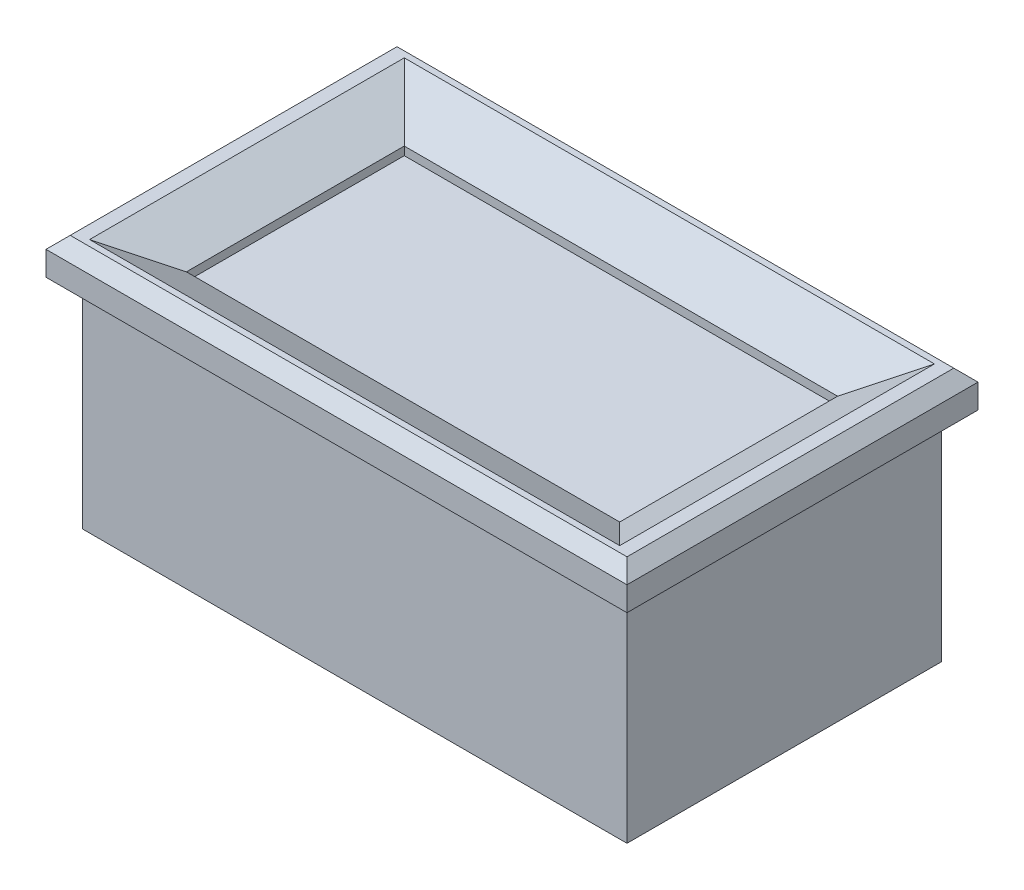
ISO-10303-21;
HEADER;
FILE_DESCRIPTION(('STEP AP214'),'2;1');
FILE_NAME('part.step','',(''),(''),'','','');
FILE_SCHEMA(('AUTOMOTIVE_DESIGN { 1 0 10303 214 1 1 1 1 }'));
ENDSEC;
DATA;
#1=APPLICATION_CONTEXT('core data for automotive mechanical design processes');
#2=APPLICATION_PROTOCOL_DEFINITION('international standard','automotive_design',2000,#1);
#3=PRODUCT_CONTEXT('',#1,'mechanical');
#4=PRODUCT('Part','Part','',(#3));
#5=PRODUCT_RELATED_PRODUCT_CATEGORY('part','',(#4));
#6=PRODUCT_DEFINITION_FORMATION('','',#4);
#7=PRODUCT_DEFINITION_CONTEXT('part definition',#1,'design');
#8=PRODUCT_DEFINITION('design','',#6,#7);
#9=PRODUCT_DEFINITION_SHAPE('','',#8);
#10=(LENGTH_UNIT() NAMED_UNIT(*) SI_UNIT(.MILLI.,.METRE.));
#11=(NAMED_UNIT(*) PLANE_ANGLE_UNIT() SI_UNIT($,.RADIAN.));
#12=(NAMED_UNIT(*) SI_UNIT($,.STERADIAN.) SOLID_ANGLE_UNIT());
#13=UNCERTAINTY_MEASURE_WITH_UNIT(LENGTH_MEASURE(1.E-05),#10,'distance_accuracy_value','');
#14=(GEOMETRIC_REPRESENTATION_CONTEXT(3) GLOBAL_UNCERTAINTY_ASSIGNED_CONTEXT((#13)) GLOBAL_UNIT_ASSIGNED_CONTEXT((#10,
#11,#12)) REPRESENTATION_CONTEXT('',''));
#15=CARTESIAN_POINT('',(0.,0.,0.));
#16=DIRECTION('',(0.,0.,1.));
#17=DIRECTION('',(1.,0.,0.));
#18=AXIS2_PLACEMENT_3D('',#15,#16,#17);
#19=CARTESIAN_POINT('',(22.5,18.,13.));
#20=DIRECTION('',(-1.,0.,0.));
#21=DIRECTION('',(0.,0.,1.));
#22=AXIS2_PLACEMENT_3D('',#19,#20,#21);
#23=PLANE('',#22);
#24=DIRECTION('',(0.,0.,-1.));
#25=VECTOR('',#24,1.);
#26=CARTESIAN_POINT('',(22.5,0.,13.));
#27=LINE('',#26,#25);
#28=CARTESIAN_POINT('',(22.5,0.,13.));
#29=VERTEX_POINT('',#28);
#30=CARTESIAN_POINT('',(22.5,0.,-13.));
#31=VERTEX_POINT('',#30);
#32=EDGE_CURVE('E225',#29,#31,#27,.T.);
#33=ORIENTED_EDGE('',*,*,#32,.T.);
#34=DIRECTION('',(0.,-1.,0.));
#35=VECTOR('',#34,1.);
#36=CARTESIAN_POINT('',(22.5,18.,-13.));
#37=LINE('',#36,#35);
#38=CARTESIAN_POINT('',(22.5,18.,-13.));
#39=VERTEX_POINT('',#38);
#40=EDGE_CURVE('E266',#39,#31,#37,.T.);
#41=ORIENTED_EDGE('',*,*,#40,.F.);
#42=DIRECTION('',(0.,0.,-1.));
#43=VECTOR('',#42,1.);
#44=CARTESIAN_POINT('',(22.5,18.,13.));
#45=LINE('',#44,#43);
#46=CARTESIAN_POINT('',(22.5,18.,13.));
#47=VERTEX_POINT('',#46);
#48=EDGE_CURVE('E226',#47,#39,#45,.T.);
#49=ORIENTED_EDGE('',*,*,#48,.F.);
#50=DIRECTION('',(0.,-1.,0.));
#51=VECTOR('',#50,1.);
#52=CARTESIAN_POINT('',(22.5,18.,13.));
#53=LINE('',#52,#51);
#54=EDGE_CURVE('E243',#47,#29,#53,.T.);
#55=ORIENTED_EDGE('',*,*,#54,.T.);
#56=EDGE_LOOP('',(#33,#41,#49,#55));
#57=FACE_BOUND('',#56,.T.);
#58=ADVANCED_FACE('F39',(#57),#23,.F.);
#59=CARTESIAN_POINT('',(-22.5,18.,-13.));
#60=DIRECTION('',(0.,0.,1.));
#61=DIRECTION('',(1.,0.,0.));
#62=AXIS2_PLACEMENT_3D('',#59,#60,#61);
#63=PLANE('',#62);
#64=DIRECTION('',(-1.,0.,0.));
#65=VECTOR('',#64,1.);
#66=CARTESIAN_POINT('',(-22.5,0.,-13.));
#67=LINE('',#66,#65);
#68=CARTESIAN_POINT('',(-22.5,0.,-13.));
#69=VERTEX_POINT('',#68);
#70=EDGE_CURVE('E247',#31,#69,#67,.T.);
#71=ORIENTED_EDGE('',*,*,#70,.T.);
#72=DIRECTION('',(0.,-1.,0.));
#73=VECTOR('',#72,1.);
#74=CARTESIAN_POINT('',(-22.5,18.,-13.));
#75=LINE('',#74,#73);
#76=CARTESIAN_POINT('',(-22.5,18.,-13.));
#77=VERTEX_POINT('',#76);
#78=EDGE_CURVE('E262',#77,#69,#75,.T.);
#79=ORIENTED_EDGE('',*,*,#78,.F.);
#80=DIRECTION('',(-1.,0.,0.));
#81=VECTOR('',#80,1.);
#82=CARTESIAN_POINT('',(-22.5,18.,-13.));
#83=LINE('',#82,#81);
#84=EDGE_CURVE('E230',#39,#77,#83,.T.);
#85=ORIENTED_EDGE('',*,*,#84,.F.);
#86=ORIENTED_EDGE('',*,*,#40,.T.);
#87=EDGE_LOOP('',(#71,#79,#85,#86));
#88=FACE_BOUND('',#87,.T.);
#89=ADVANCED_FACE('F362',(#88),#63,.F.);
#90=CARTESIAN_POINT('',(-22.5,18.,13.));
#91=DIRECTION('',(1.,0.,0.));
#92=DIRECTION('',(0.,0.,-1.));
#93=AXIS2_PLACEMENT_3D('',#90,#91,#92);
#94=PLANE('',#93);
#95=DIRECTION('',(0.,0.,1.));
#96=VECTOR('',#95,1.);
#97=CARTESIAN_POINT('',(-22.5,0.,13.));
#98=LINE('',#97,#96);
#99=CARTESIAN_POINT('',(-22.5,0.,13.));
#100=VERTEX_POINT('',#99);
#101=EDGE_CURVE('E250',#69,#100,#98,.T.);
#102=ORIENTED_EDGE('',*,*,#101,.T.);
#103=DIRECTION('',(0.,-1.,0.));
#104=VECTOR('',#103,1.);
#105=CARTESIAN_POINT('',(-22.5,18.,13.));
#106=LINE('',#105,#104);
#107=CARTESIAN_POINT('',(-22.5,18.,13.));
#108=VERTEX_POINT('',#107);
#109=EDGE_CURVE('E258',#108,#100,#106,.T.);
#110=ORIENTED_EDGE('',*,*,#109,.F.);
#111=DIRECTION('',(0.,0.,1.));
#112=VECTOR('',#111,1.);
#113=CARTESIAN_POINT('',(-22.5,18.,13.));
#114=LINE('',#113,#112);
#115=EDGE_CURVE('E235',#77,#108,#114,.T.);
#116=ORIENTED_EDGE('',*,*,#115,.F.);
#117=ORIENTED_EDGE('',*,*,#78,.T.);
#118=EDGE_LOOP('',(#102,#110,#116,#117));
#119=FACE_BOUND('',#118,.T.);
#120=ADVANCED_FACE('F368',(#119),#94,.F.);
#121=CARTESIAN_POINT('',(-22.5,18.,13.));
#122=DIRECTION('',(0.,0.,-1.));
#123=DIRECTION('',(-1.,0.,0.));
#124=AXIS2_PLACEMENT_3D('',#121,#122,#123);
#125=PLANE('',#124);
#126=DIRECTION('',(1.,0.,0.));
#127=VECTOR('',#126,1.);
#128=CARTESIAN_POINT('',(-22.5,0.,13.));
#129=LINE('',#128,#127);
#130=EDGE_CURVE('E231',#100,#29,#129,.T.);
#131=ORIENTED_EDGE('',*,*,#130,.T.);
#132=ORIENTED_EDGE('',*,*,#54,.F.);
#133=DIRECTION('',(1.,0.,0.));
#134=VECTOR('',#133,1.);
#135=CARTESIAN_POINT('',(-22.5,18.,13.));
#136=LINE('',#135,#134);
#137=EDGE_CURVE('E239',#108,#47,#136,.T.);
#138=ORIENTED_EDGE('',*,*,#137,.F.);
#139=ORIENTED_EDGE('',*,*,#109,.T.);
#140=EDGE_LOOP('',(#131,#132,#138,#139));
#141=FACE_BOUND('',#140,.T.);
#142=ADVANCED_FACE('F432',(#141),#125,.F.);
#143=CARTESIAN_POINT('',(0.,0.,0.));
#144=DIRECTION('',(0.,-1.,0.));
#145=DIRECTION('',(0.,0.,-1.));
#146=AXIS2_PLACEMENT_3D('',#143,#144,#145);
#147=PLANE('',#146);
#148=ORIENTED_EDGE('',*,*,#32,.F.);
#149=ORIENTED_EDGE('',*,*,#130,.F.);
#150=ORIENTED_EDGE('',*,*,#101,.F.);
#151=ORIENTED_EDGE('',*,*,#70,.F.);
#152=EDGE_LOOP('',(#148,#149,#150,#151));
#153=FACE_BOUND('',#152,.T.);
#154=ADVANCED_FACE('F425',(#153),#147,.T.);
#155=CARTESIAN_POINT('',(0.,18.,0.));
#156=DIRECTION('',(0.,-1.,0.));
#157=DIRECTION('',(0.,0.,-1.));
#158=AXIS2_PLACEMENT_3D('',#155,#156,#157);
#159=PLANE('',#158);
#160=DIRECTION('',(0.,0.,-1.));
#161=VECTOR('',#160,1.);
#162=CARTESIAN_POINT('',(24.,18.,14.5));
#163=LINE('',#162,#161);
#164=CARTESIAN_POINT('',(24.,18.,14.5));
#165=VERTEX_POINT('',#164);
#166=CARTESIAN_POINT('',(24.,18.,-14.5));
#167=VERTEX_POINT('',#166);
#168=EDGE_CURVE('E163',#165,#167,#163,.T.);
#169=ORIENTED_EDGE('',*,*,#168,.F.);
#170=DIRECTION('',(1.,0.,0.));
#171=VECTOR('',#170,1.);
#172=CARTESIAN_POINT('',(-24.,18.,14.5));
#173=LINE('',#172,#171);
#174=CARTESIAN_POINT('',(-24.,18.,14.5));
#175=VERTEX_POINT('',#174);
#176=EDGE_CURVE('E209',#175,#165,#173,.T.);
#177=ORIENTED_EDGE('',*,*,#176,.F.);
#178=DIRECTION('',(0.,0.,1.));
#179=VECTOR('',#178,1.);
#180=CARTESIAN_POINT('',(-24.,18.,14.5));
#181=LINE('',#180,#179);
#182=CARTESIAN_POINT('',(-24.,18.,-14.5));
#183=VERTEX_POINT('',#182);
#184=EDGE_CURVE('E205',#183,#175,#181,.T.);
#185=ORIENTED_EDGE('',*,*,#184,.F.);
#186=DIRECTION('',(-1.,0.,0.));
#187=VECTOR('',#186,1.);
#188=CARTESIAN_POINT('',(-24.,18.,-14.5));
#189=LINE('',#188,#187);
#190=EDGE_CURVE('E201',#167,#183,#189,.T.);
#191=ORIENTED_EDGE('',*,*,#190,.F.);
#192=EDGE_LOOP('',(#169,#177,#185,#191));
#193=FACE_BOUND('',#192,.T.);
#194=ORIENTED_EDGE('',*,*,#48,.T.);
#195=ORIENTED_EDGE('',*,*,#84,.T.);
#196=ORIENTED_EDGE('',*,*,#115,.T.);
#197=ORIENTED_EDGE('',*,*,#137,.T.);
#198=EDGE_LOOP('',(#194,#195,#196,#197));
#199=FACE_BOUND('',#198,.T.);
#200=ADVANCED_FACE('F422',(#193,#199),#159,.T.);
#201=CARTESIAN_POINT('',(0.,21.,0.));
#202=DIRECTION('',(0.,-1.,0.));
#203=DIRECTION('',(0.,0.,-1.));
#204=AXIS2_PLACEMENT_3D('',#201,#202,#203);
#205=PLANE('',#204);
#206=DIRECTION('',(1.,0.,0.));
#207=VECTOR('',#206,1.);
#208=CARTESIAN_POINT('',(17.9,21.,-13.));
#209=LINE('',#208,#207);
#210=CARTESIAN_POINT('',(-21.9,21.,-13.));
#211=VERTEX_POINT('',#210);
#212=CARTESIAN_POINT('',(21.9,21.,-13.));
#213=VERTEX_POINT('',#212);
#214=EDGE_CURVE('E307',#211,#213,#209,.T.);
#215=ORIENTED_EDGE('',*,*,#214,.T.);
#216=DIRECTION('',(0.,0.,1.));
#217=VECTOR('',#216,1.);
#218=CARTESIAN_POINT('',(21.9,21.,9.));
#219=LINE('',#218,#217);
#220=CARTESIAN_POINT('',(21.9,21.,13.));
#221=VERTEX_POINT('',#220);
#222=EDGE_CURVE('E316',#213,#221,#219,.T.);
#223=ORIENTED_EDGE('',*,*,#222,.T.);
#224=DIRECTION('',(-1.,0.,0.));
#225=VECTOR('',#224,1.);
#226=CARTESIAN_POINT('',(-17.9,21.,13.));
#227=LINE('',#226,#225);
#228=CARTESIAN_POINT('',(-21.9,21.,13.));
#229=VERTEX_POINT('',#228);
#230=EDGE_CURVE('E313',#221,#229,#227,.T.);
#231=ORIENTED_EDGE('',*,*,#230,.T.);
#232=DIRECTION('',(0.,0.,-1.));
#233=VECTOR('',#232,1.);
#234=CARTESIAN_POINT('',(-21.9,21.,-9.));
#235=LINE('',#234,#233);
#236=EDGE_CURVE('E310',#229,#211,#235,.T.);
#237=ORIENTED_EDGE('',*,*,#236,.T.);
#238=EDGE_LOOP('',(#215,#223,#231,#237));
#239=FACE_BOUND('',#238,.T.);
#240=DIRECTION('',(0.,0.,-1.));
#241=VECTOR('',#240,1.);
#242=CARTESIAN_POINT('',(23.,21.,0.));
#243=LINE('',#242,#241);
#244=CARTESIAN_POINT('',(23.,21.,13.5));
#245=VERTEX_POINT('',#244);
#246=CARTESIAN_POINT('',(23.,21.,-13.5));
#247=VERTEX_POINT('',#246);
#248=EDGE_CURVE('E276',#245,#247,#243,.T.);
#249=ORIENTED_EDGE('',*,*,#248,.T.);
#250=DIRECTION('',(-1.,0.,0.));
#251=VECTOR('',#250,1.);
#252=CARTESIAN_POINT('',(0.,21.,-13.5));
#253=LINE('',#252,#251);
#254=CARTESIAN_POINT('',(-23.,21.,-13.5));
#255=VERTEX_POINT('',#254);
#256=EDGE_CURVE('E279',#247,#255,#253,.T.);
#257=ORIENTED_EDGE('',*,*,#256,.T.);
#258=DIRECTION('',(0.,0.,1.));
#259=VECTOR('',#258,1.);
#260=CARTESIAN_POINT('',(-23.,21.,0.));
#261=LINE('',#260,#259);
#262=CARTESIAN_POINT('',(-23.,21.,13.5));
#263=VERTEX_POINT('',#262);
#264=EDGE_CURVE('E273',#255,#263,#261,.T.);
#265=ORIENTED_EDGE('',*,*,#264,.T.);
#266=DIRECTION('',(1.,0.,0.));
#267=VECTOR('',#266,1.);
#268=CARTESIAN_POINT('',(0.,21.,13.5));
#269=LINE('',#268,#267);
#270=EDGE_CURVE('E270',#263,#245,#269,.T.);
#271=ORIENTED_EDGE('',*,*,#270,.T.);
#272=EDGE_LOOP('',(#249,#257,#265,#271));
#273=FACE_BOUND('',#272,.T.);
#274=ADVANCED_FACE('F347',(#239,#273),#205,.F.);
#275=CARTESIAN_POINT('',(24.,21.,14.5));
#276=DIRECTION('',(-1.,0.,0.));
#277=DIRECTION('',(0.,0.,1.));
#278=AXIS2_PLACEMENT_3D('',#275,#276,#277);
#279=PLANE('',#278);
#280=DIRECTION('',(0.,-1.,0.));
#281=VECTOR('',#280,1.);
#282=CARTESIAN_POINT('',(24.,21.,-14.5));
#283=LINE('',#282,#281);
#284=CARTESIAN_POINT('',(24.,20.,-14.5));
#285=VERTEX_POINT('',#284);
#286=EDGE_CURVE('E222',#285,#167,#283,.T.);
#287=ORIENTED_EDGE('',*,*,#286,.F.);
#288=DIRECTION('',(0.,0.,1.));
#289=VECTOR('',#288,1.);
#290=CARTESIAN_POINT('',(24.,20.,14.5));
#291=LINE('',#290,#289);
#292=CARTESIAN_POINT('',(24.,20.,14.5));
#293=VERTEX_POINT('',#292);
#294=EDGE_CURVE('E287',#285,#293,#291,.T.);
#295=ORIENTED_EDGE('',*,*,#294,.T.);
#296=DIRECTION('',(0.,-1.,0.));
#297=VECTOR('',#296,1.);
#298=CARTESIAN_POINT('',(24.,21.,14.5));
#299=LINE('',#298,#297);
#300=EDGE_CURVE('E213',#293,#165,#299,.T.);
#301=ORIENTED_EDGE('',*,*,#300,.T.);
#302=ORIENTED_EDGE('',*,*,#168,.T.);
#303=EDGE_LOOP('',(#287,#295,#301,#302));
#304=FACE_BOUND('',#303,.T.);
#305=ADVANCED_FACE('F416',(#304),#279,.F.);
#306=CARTESIAN_POINT('',(-24.,21.,-14.5));
#307=DIRECTION('',(0.,0.,1.));
#308=DIRECTION('',(1.,0.,0.));
#309=AXIS2_PLACEMENT_3D('',#306,#307,#308);
#310=PLANE('',#309);
#311=DIRECTION('',(0.,-1.,0.));
#312=VECTOR('',#311,1.);
#313=CARTESIAN_POINT('',(-24.,21.,-14.5));
#314=LINE('',#313,#312);
#315=CARTESIAN_POINT('',(-24.,20.,-14.5));
#316=VERTEX_POINT('',#315);
#317=EDGE_CURVE('E219',#316,#183,#314,.T.);
#318=ORIENTED_EDGE('',*,*,#317,.F.);
#319=DIRECTION('',(1.,0.,0.));
#320=VECTOR('',#319,1.);
#321=CARTESIAN_POINT('',(-24.,20.,-14.5));
#322=LINE('',#321,#320);
#323=EDGE_CURVE('E283',#316,#285,#322,.T.);
#324=ORIENTED_EDGE('',*,*,#323,.T.);
#325=ORIENTED_EDGE('',*,*,#286,.T.);
#326=ORIENTED_EDGE('',*,*,#190,.T.);
#327=EDGE_LOOP('',(#318,#324,#325,#326));
#328=FACE_BOUND('',#327,.T.);
#329=ADVANCED_FACE('F406',(#328),#310,.F.);
#330=CARTESIAN_POINT('',(-24.,21.,14.5));
#331=DIRECTION('',(1.,0.,0.));
#332=DIRECTION('',(0.,0.,-1.));
#333=AXIS2_PLACEMENT_3D('',#330,#331,#332);
#334=PLANE('',#333);
#335=DIRECTION('',(0.,-1.,0.));
#336=VECTOR('',#335,1.);
#337=CARTESIAN_POINT('',(-24.,21.,14.5));
#338=LINE('',#337,#336);
#339=CARTESIAN_POINT('',(-24.,20.,14.5));
#340=VERTEX_POINT('',#339);
#341=EDGE_CURVE('E216',#340,#175,#338,.T.);
#342=ORIENTED_EDGE('',*,*,#341,.F.);
#343=DIRECTION('',(0.,0.,-1.));
#344=VECTOR('',#343,1.);
#345=CARTESIAN_POINT('',(-24.,20.,14.5));
#346=LINE('',#345,#344);
#347=EDGE_CURVE('E290',#340,#316,#346,.T.);
#348=ORIENTED_EDGE('',*,*,#347,.T.);
#349=ORIENTED_EDGE('',*,*,#317,.T.);
#350=ORIENTED_EDGE('',*,*,#184,.T.);
#351=EDGE_LOOP('',(#342,#348,#349,#350));
#352=FACE_BOUND('',#351,.T.);
#353=ADVANCED_FACE('F403',(#352),#334,.F.);
#354=CARTESIAN_POINT('',(-24.,21.,14.5));
#355=DIRECTION('',(0.,0.,-1.));
#356=DIRECTION('',(-1.,0.,0.));
#357=AXIS2_PLACEMENT_3D('',#354,#355,#356);
#358=PLANE('',#357);
#359=ORIENTED_EDGE('',*,*,#300,.F.);
#360=DIRECTION('',(-1.,0.,0.));
#361=VECTOR('',#360,1.);
#362=CARTESIAN_POINT('',(-24.,20.,14.5));
#363=LINE('',#362,#361);
#364=EDGE_CURVE('E293',#293,#340,#363,.T.);
#365=ORIENTED_EDGE('',*,*,#364,.T.);
#366=ORIENTED_EDGE('',*,*,#341,.T.);
#367=ORIENTED_EDGE('',*,*,#176,.T.);
#368=EDGE_LOOP('',(#359,#365,#366,#367));
#369=FACE_BOUND('',#368,.T.);
#370=ADVANCED_FACE('F418',(#369),#358,.F.);
#371=CARTESIAN_POINT('',(17.9,21.,9.));
#372=DIRECTION('',(-1.,0.,0.));
#373=DIRECTION('',(0.,0.,1.));
#374=AXIS2_PLACEMENT_3D('',#371,#372,#373);
#375=PLANE('',#374);
#376=DIRECTION('',(0.,-1.,0.));
#377=VECTOR('',#376,1.);
#378=CARTESIAN_POINT('',(17.9,21.,9.));
#379=LINE('',#378,#377);
#380=CARTESIAN_POINT('',(17.9,18.6905989232415,9.));
#381=VERTEX_POINT('',#380);
#382=CARTESIAN_POINT('',(17.9,18.,9.));
#383=VERTEX_POINT('',#382);
#384=EDGE_CURVE('E190',#381,#383,#379,.T.);
#385=ORIENTED_EDGE('',*,*,#384,.F.);
#386=DIRECTION('',(0.,0.,-1.));
#387=VECTOR('',#386,1.);
#388=CARTESIAN_POINT('',(17.9,18.6905989232415,-9.));
#389=LINE('',#388,#387);
#390=CARTESIAN_POINT('',(17.9,18.6905989232415,-9.));
#391=VERTEX_POINT('',#390);
#392=EDGE_CURVE('E161',#381,#391,#389,.T.);
#393=ORIENTED_EDGE('',*,*,#392,.T.);
#394=DIRECTION('',(0.,-1.,0.));
#395=VECTOR('',#394,1.);
#396=CARTESIAN_POINT('',(17.9,21.,-9.));
#397=LINE('',#396,#395);
#398=CARTESIAN_POINT('',(17.9,18.,-9.));
#399=VERTEX_POINT('',#398);
#400=EDGE_CURVE('E153',#391,#399,#397,.T.);
#401=ORIENTED_EDGE('',*,*,#400,.T.);
#402=DIRECTION('',(0.,0.,-1.));
#403=VECTOR('',#402,1.);
#404=CARTESIAN_POINT('',(17.9,18.,9.));
#405=LINE('',#404,#403);
#406=EDGE_CURVE('E158',#383,#399,#405,.T.);
#407=ORIENTED_EDGE('',*,*,#406,.F.);
#408=EDGE_LOOP('',(#385,#393,#401,#407));
#409=FACE_BOUND('',#408,.T.);
#410=ADVANCED_FACE('F156',(#409),#375,.T.);
#411=CARTESIAN_POINT('',(-17.9,21.,-9.));
#412=DIRECTION('',(0.,0.,1.));
#413=DIRECTION('',(1.,0.,0.));
#414=AXIS2_PLACEMENT_3D('',#411,#412,#413);
#415=PLANE('',#414);
#416=ORIENTED_EDGE('',*,*,#400,.F.);
#417=DIRECTION('',(-1.,0.,0.));
#418=VECTOR('',#417,1.);
#419=CARTESIAN_POINT('',(-17.9,18.6905989232415,-9.));
#420=LINE('',#419,#418);
#421=CARTESIAN_POINT('',(-17.9,18.6905989232415,-9.));
#422=VERTEX_POINT('',#421);
#423=EDGE_CURVE('E11',#391,#422,#420,.T.);
#424=ORIENTED_EDGE('',*,*,#423,.T.);
#425=DIRECTION('',(0.,-1.,0.));
#426=VECTOR('',#425,1.);
#427=CARTESIAN_POINT('',(-17.9,21.,-9.));
#428=LINE('',#427,#426);
#429=CARTESIAN_POINT('',(-17.9,18.,-9.));
#430=VERTEX_POINT('',#429);
#431=EDGE_CURVE('E164',#422,#430,#428,.T.);
#432=ORIENTED_EDGE('',*,*,#431,.T.);
#433=DIRECTION('',(-1.,0.,0.));
#434=VECTOR('',#433,1.);
#435=CARTESIAN_POINT('',(-17.9,18.,-9.));
#436=LINE('',#435,#434);
#437=EDGE_CURVE('E167',#399,#430,#436,.T.);
#438=ORIENTED_EDGE('',*,*,#437,.F.);
#439=EDGE_LOOP('',(#416,#424,#432,#438));
#440=FACE_BOUND('',#439,.T.);
#441=ADVANCED_FACE('F168',(#440),#415,.T.);
#442=CARTESIAN_POINT('',(-17.9,21.,9.));
#443=DIRECTION('',(1.,0.,0.));
#444=DIRECTION('',(0.,0.,-1.));
#445=AXIS2_PLACEMENT_3D('',#442,#443,#444);
#446=PLANE('',#445);
#447=ORIENTED_EDGE('',*,*,#431,.F.);
#448=DIRECTION('',(0.,0.,1.));
#449=VECTOR('',#448,1.);
#450=CARTESIAN_POINT('',(-17.9,18.6905989232415,9.));
#451=LINE('',#450,#449);
#452=CARTESIAN_POINT('',(-17.9,18.6905989232415,9.));
#453=VERTEX_POINT('',#452);
#454=EDGE_CURVE('E49',#422,#453,#451,.T.);
#455=ORIENTED_EDGE('',*,*,#454,.T.);
#456=DIRECTION('',(0.,-1.,0.));
#457=VECTOR('',#456,1.);
#458=CARTESIAN_POINT('',(-17.9,21.,9.));
#459=LINE('',#458,#457);
#460=CARTESIAN_POINT('',(-17.9,18.,9.));
#461=VERTEX_POINT('',#460);
#462=EDGE_CURVE('E193',#453,#461,#459,.T.);
#463=ORIENTED_EDGE('',*,*,#462,.T.);
#464=DIRECTION('',(0.,0.,1.));
#465=VECTOR('',#464,1.);
#466=CARTESIAN_POINT('',(-17.9,18.,9.));
#467=LINE('',#466,#465);
#468=EDGE_CURVE('E173',#430,#461,#467,.T.);
#469=ORIENTED_EDGE('',*,*,#468,.F.);
#470=EDGE_LOOP('',(#447,#455,#463,#469));
#471=FACE_BOUND('',#470,.T.);
#472=ADVANCED_FACE('F460',(#471),#446,.T.);
#473=CARTESIAN_POINT('',(-17.9,21.,9.));
#474=DIRECTION('',(0.,0.,-1.));
#475=DIRECTION('',(-1.,0.,0.));
#476=AXIS2_PLACEMENT_3D('',#473,#474,#475);
#477=PLANE('',#476);
#478=ORIENTED_EDGE('',*,*,#462,.F.);
#479=DIRECTION('',(1.,0.,0.));
#480=VECTOR('',#479,1.);
#481=CARTESIAN_POINT('',(17.9,18.6905989232415,9.));
#482=LINE('',#481,#480);
#483=EDGE_CURVE('E320',#453,#381,#482,.T.);
#484=ORIENTED_EDGE('',*,*,#483,.T.);
#485=ORIENTED_EDGE('',*,*,#384,.T.);
#486=DIRECTION('',(1.,0.,0.));
#487=VECTOR('',#486,1.);
#488=CARTESIAN_POINT('',(-17.9,18.,9.));
#489=LINE('',#488,#487);
#490=EDGE_CURVE('E177',#461,#383,#489,.T.);
#491=ORIENTED_EDGE('',*,*,#490,.F.);
#492=EDGE_LOOP('',(#478,#484,#485,#491));
#493=FACE_BOUND('',#492,.T.);
#494=ADVANCED_FACE('F391',(#493),#477,.T.);
#495=CARTESIAN_POINT('',(0.,18.,0.));
#496=DIRECTION('',(0.,-1.,0.));
#497=DIRECTION('',(0.,0.,-1.));
#498=AXIS2_PLACEMENT_3D('',#495,#496,#497);
#499=PLANE('',#498);
#500=ORIENTED_EDGE('',*,*,#490,.T.);
#501=ORIENTED_EDGE('',*,*,#406,.T.);
#502=ORIENTED_EDGE('',*,*,#437,.T.);
#503=ORIENTED_EDGE('',*,*,#468,.T.);
#504=EDGE_LOOP('',(#500,#501,#502,#503));
#505=FACE_BOUND('',#504,.T.);
#506=ADVANCED_FACE('F175',(#505),#499,.F.);
#507=CARTESIAN_POINT('',(0.,21.,13.5));
#508=DIRECTION('',(0.,-0.707106781186545,-0.70710678118655));
#509=DIRECTION('',(1.,0.,0.));
#510=AXIS2_PLACEMENT_3D('',#507,#508,#509);
#511=PLANE('',#510);
#512=DIRECTION('',(-0.577350269189624,-0.577350269189628,0.577350269189624));
#513=VECTOR('',#512,1.);
#514=CARTESIAN_POINT('',(-15.3333333333334,28.6666666666667,5.83333333333337));
#515=LINE('',#514,#513);
#516=EDGE_CURVE('E183',#340,#263,#515,.F.);
#517=ORIENTED_EDGE('',*,*,#516,.F.);
#518=ORIENTED_EDGE('',*,*,#364,.F.);
#519=DIRECTION('',(-0.577350269189624,0.577350269189628,-0.577350269189624));
#520=VECTOR('',#519,1.);
#521=CARTESIAN_POINT('',(15.3333333333334,28.6666666666667,5.83333333333337));
#522=LINE('',#521,#520);
#523=EDGE_CURVE('E179',#245,#293,#522,.F.);
#524=ORIENTED_EDGE('',*,*,#523,.F.);
#525=ORIENTED_EDGE('',*,*,#270,.F.);
#526=EDGE_LOOP('',(#517,#518,#524,#525));
#527=FACE_BOUND('',#526,.T.);
#528=ADVANCED_FACE('F384',(#527),#511,.F.);
#529=CARTESIAN_POINT('',(23.,21.,0.));
#530=DIRECTION('',(-0.70710678118655,-0.707106781186545,0.));
#531=DIRECTION('',(0.,0.,-1.));
#532=AXIS2_PLACEMENT_3D('',#529,#530,#531);
#533=PLANE('',#532);
#534=ORIENTED_EDGE('',*,*,#523,.T.);
#535=ORIENTED_EDGE('',*,*,#294,.F.);
#536=DIRECTION('',(-0.577350269189624,0.577350269189628,0.577350269189624));
#537=VECTOR('',#536,1.);
#538=CARTESIAN_POINT('',(18.5,25.5,-9.00000000000002));
#539=LINE('',#538,#537);
#540=EDGE_CURVE('E299',#247,#285,#539,.F.);
#541=ORIENTED_EDGE('',*,*,#540,.F.);
#542=ORIENTED_EDGE('',*,*,#248,.F.);
#543=EDGE_LOOP('',(#534,#535,#541,#542));
#544=FACE_BOUND('',#543,.T.);
#545=ADVANCED_FACE('F380',(#544),#533,.F.);
#546=CARTESIAN_POINT('',(-23.,21.,0.));
#547=DIRECTION('',(0.70710678118655,-0.707106781186545,0.));
#548=DIRECTION('',(0.,0.,1.));
#549=AXIS2_PLACEMENT_3D('',#546,#547,#548);
#550=PLANE('',#549);
#551=ORIENTED_EDGE('',*,*,#516,.T.);
#552=ORIENTED_EDGE('',*,*,#264,.F.);
#553=DIRECTION('',(-0.577350269189624,-0.577350269189628,-0.577350269189624));
#554=VECTOR('',#553,1.);
#555=CARTESIAN_POINT('',(-18.5,25.5,-9.00000000000002));
#556=LINE('',#555,#554);
#557=EDGE_CURVE('E296',#316,#255,#556,.F.);
#558=ORIENTED_EDGE('',*,*,#557,.F.);
#559=ORIENTED_EDGE('',*,*,#347,.F.);
#560=EDGE_LOOP('',(#551,#552,#558,#559));
#561=FACE_BOUND('',#560,.T.);
#562=ADVANCED_FACE('F376',(#561),#550,.F.);
#563=CARTESIAN_POINT('',(0.,21.,-13.5));
#564=DIRECTION('',(0.,-0.707106781186545,0.70710678118655));
#565=DIRECTION('',(-1.,0.,0.));
#566=AXIS2_PLACEMENT_3D('',#563,#564,#565);
#567=PLANE('',#566);
#568=ORIENTED_EDGE('',*,*,#540,.T.);
#569=ORIENTED_EDGE('',*,*,#323,.F.);
#570=ORIENTED_EDGE('',*,*,#557,.T.);
#571=ORIENTED_EDGE('',*,*,#256,.F.);
#572=EDGE_LOOP('',(#568,#569,#570,#571));
#573=FACE_BOUND('',#572,.T.);
#574=ADVANCED_FACE('F373',(#573),#567,.F.);
#575=CARTESIAN_POINT('',(-17.9,18.6905989232415,9.));
#576=DIRECTION('',(0.499999999999998,0.86602540378444,0.));
#577=DIRECTION('',(0.,0.,-1.));
#578=AXIS2_PLACEMENT_3D('',#575,#576,#577);
#579=PLANE('',#578);
#580=DIRECTION('',(0.654653670707978,-0.377964473009225,0.654653670707978));
#581=VECTOR('',#580,1.);
#582=CARTESIAN_POINT('',(-10.1857142857143,14.236753989493,-1.28571428571427));
#583=LINE('',#582,#581);
#584=EDGE_CURVE('E330',#211,#422,#583,.T.);
#585=ORIENTED_EDGE('',*,*,#584,.F.);
#586=ORIENTED_EDGE('',*,*,#236,.F.);
#587=DIRECTION('',(0.654653670707978,-0.377964473009225,-0.654653670707978));
#588=VECTOR('',#587,1.);
#589=CARTESIAN_POINT('',(-17.9,18.6905989232415,9.));
#590=LINE('',#589,#588);
#591=EDGE_CURVE('E43',#453,#229,#590,.F.);
#592=ORIENTED_EDGE('',*,*,#591,.F.);
#593=ORIENTED_EDGE('',*,*,#454,.F.);
#594=EDGE_LOOP('',(#585,#586,#592,#593));
#595=FACE_BOUND('',#594,.T.);
#596=ADVANCED_FACE('F41',(#595),#579,.T.);
#597=CARTESIAN_POINT('',(-17.9,18.6905989232415,9.));
#598=DIRECTION('',(0.,0.86602540378444,-0.499999999999998));
#599=DIRECTION('',(-1.,0.,0.));
#600=AXIS2_PLACEMENT_3D('',#597,#598,#599);
#601=PLANE('',#600);
#602=ORIENTED_EDGE('',*,*,#591,.T.);
#603=ORIENTED_EDGE('',*,*,#230,.F.);
#604=DIRECTION('',(-0.654653670707978,-0.377964473009225,-0.654653670707978));
#605=VECTOR('',#604,1.);
#606=CARTESIAN_POINT('',(17.9,18.6905989232415,9.));
#607=LINE('',#606,#605);
#608=EDGE_CURVE('E328',#381,#221,#607,.F.);
#609=ORIENTED_EDGE('',*,*,#608,.F.);
#610=ORIENTED_EDGE('',*,*,#483,.F.);
#611=EDGE_LOOP('',(#602,#603,#609,#610));
#612=FACE_BOUND('',#611,.T.);
#613=ADVANCED_FACE('F342',(#612),#601,.T.);
#614=CARTESIAN_POINT('',(-17.9,18.6905989232415,-9.));
#615=DIRECTION('',(0.,0.86602540378444,0.499999999999998));
#616=DIRECTION('',(1.,0.,0.));
#617=AXIS2_PLACEMENT_3D('',#614,#615,#616);
#618=PLANE('',#617);
#619=ORIENTED_EDGE('',*,*,#584,.T.);
#620=ORIENTED_EDGE('',*,*,#423,.F.);
#621=DIRECTION('',(0.654653670707978,0.377964473009225,-0.654653670707978));
#622=VECTOR('',#621,1.);
#623=CARTESIAN_POINT('',(10.1857142857143,14.236753989493,-1.28571428571427));
#624=LINE('',#623,#622);
#625=EDGE_CURVE('E325',#213,#391,#624,.F.);
#626=ORIENTED_EDGE('',*,*,#625,.F.);
#627=ORIENTED_EDGE('',*,*,#214,.F.);
#628=EDGE_LOOP('',(#619,#620,#626,#627));
#629=FACE_BOUND('',#628,.T.);
#630=ADVANCED_FACE('F353',(#629),#618,.T.);
#631=CARTESIAN_POINT('',(17.9,18.6905989232415,9.));
#632=DIRECTION('',(-0.499999999999998,0.86602540378444,0.));
#633=DIRECTION('',(0.,0.,1.));
#634=AXIS2_PLACEMENT_3D('',#631,#632,#633);
#635=PLANE('',#634);
#636=ORIENTED_EDGE('',*,*,#608,.T.);
#637=ORIENTED_EDGE('',*,*,#222,.F.);
#638=ORIENTED_EDGE('',*,*,#625,.T.);
#639=ORIENTED_EDGE('',*,*,#392,.F.);
#640=EDGE_LOOP('',(#636,#637,#638,#639));
#641=FACE_BOUND('',#640,.T.);
#642=ADVANCED_FACE('F352',(#641),#635,.T.);
#643=CLOSED_SHELL('',(#58,#89,#120,#142,#154,#200,#274,#305,#329,#353,#370,#410,#441,#472,#494,
#506,#528,#545,#562,#574,#596,#613,#630,#642));
#644=MANIFOLD_SOLID_BREP('B2',#643);
#645=ADVANCED_BREP_SHAPE_REPRESENTATION('',(#18,#644),#14);
#646=SHAPE_DEFINITION_REPRESENTATION(#9,#645);
ENDSEC;
END-ISO-10303-21;
